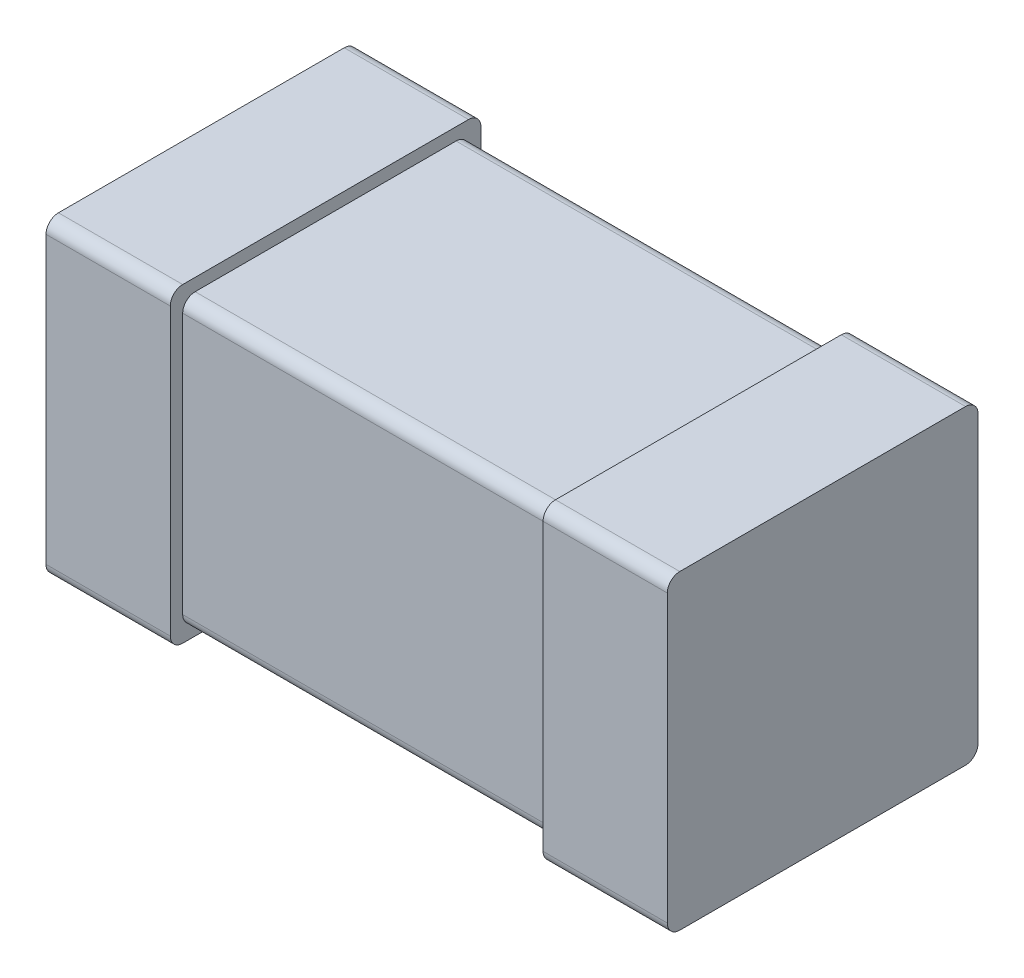
ISO-10303-21;
HEADER;
FILE_DESCRIPTION(('STEP AP214'),'2;1');
FILE_NAME('part.step','',(''),(''),'','','');
FILE_SCHEMA(('AUTOMOTIVE_DESIGN { 1 0 10303 214 1 1 1 1 }'));
ENDSEC;
DATA;
#1=APPLICATION_CONTEXT('core data for automotive mechanical design processes');
#2=APPLICATION_PROTOCOL_DEFINITION('international standard','automotive_design',2000,#1);
#3=PRODUCT_CONTEXT('',#1,'mechanical');
#4=PRODUCT('Part','Part','',(#3));
#5=PRODUCT_RELATED_PRODUCT_CATEGORY('part','',(#4));
#6=PRODUCT_DEFINITION_FORMATION('','',#4);
#7=PRODUCT_DEFINITION_CONTEXT('part definition',#1,'design');
#8=PRODUCT_DEFINITION('design','',#6,#7);
#9=PRODUCT_DEFINITION_SHAPE('','',#8);
#10=(LENGTH_UNIT() NAMED_UNIT(*) SI_UNIT(.MILLI.,.METRE.));
#11=(NAMED_UNIT(*) PLANE_ANGLE_UNIT() SI_UNIT($,.RADIAN.));
#12=(NAMED_UNIT(*) SI_UNIT($,.STERADIAN.) SOLID_ANGLE_UNIT());
#13=UNCERTAINTY_MEASURE_WITH_UNIT(LENGTH_MEASURE(1.E-05),#10,'distance_accuracy_value','');
#14=(GEOMETRIC_REPRESENTATION_CONTEXT(3) GLOBAL_UNCERTAINTY_ASSIGNED_CONTEXT((#13)) GLOBAL_UNIT_ASSIGNED_CONTEXT((#10,
#11,#12)) REPRESENTATION_CONTEXT('',''));
#15=CARTESIAN_POINT('',(0.,0.,0.));
#16=DIRECTION('',(0.,0.,1.));
#17=DIRECTION('',(1.,0.,0.));
#18=AXIS2_PLACEMENT_3D('',#15,#16,#17);
#19=CARTESIAN_POINT('',(0.5,-0.25,0.));
#20=DIRECTION('',(1.,0.,0.));
#21=DIRECTION('',(0.,1.,0.));
#22=AXIS2_PLACEMENT_3D('',#19,#20,#21);
#23=PLANE('',#22);
#24=DIRECTION('',(0.,0.,1.));
#25=VECTOR('',#24,1.);
#26=CARTESIAN_POINT('',(0.5,-0.25,0.));
#27=LINE('',#26,#25);
#28=CARTESIAN_POINT('',(0.5,-0.25,0.02));
#29=VERTEX_POINT('',#28);
#30=CARTESIAN_POINT('',(0.5,-0.25,0.48));
#31=VERTEX_POINT('',#30);
#32=EDGE_CURVE('E250',#29,#31,#27,.T.);
#33=ORIENTED_EDGE('',*,*,#32,.F.);
#34=CARTESIAN_POINT('',(0.5,-0.23,0.02));
#35=DIRECTION('',(1.,0.,0.));
#36=DIRECTION('',(0.,0.,1.));
#37=AXIS2_PLACEMENT_3D('',#34,#35,#36);
#38=CIRCLE('',#37,0.02);
#39=CARTESIAN_POINT('',(0.5,-0.23,0.));
#40=VERTEX_POINT('',#39);
#41=EDGE_CURVE('E290',#29,#40,#38,.T.);
#42=ORIENTED_EDGE('',*,*,#41,.T.);
#43=DIRECTION('',(0.,1.,0.));
#44=VECTOR('',#43,1.);
#45=CARTESIAN_POINT('',(0.5,-0.25,0.));
#46=LINE('',#45,#44);
#47=CARTESIAN_POINT('',(0.5,0.23,0.));
#48=VERTEX_POINT('',#47);
#49=EDGE_CURVE('E256',#40,#48,#46,.T.);
#50=ORIENTED_EDGE('',*,*,#49,.T.);
#51=CARTESIAN_POINT('',(0.5,0.23,0.02));
#52=DIRECTION('',(-1.,0.,0.));
#53=DIRECTION('',(0.,0.,1.));
#54=AXIS2_PLACEMENT_3D('',#51,#52,#53);
#55=CIRCLE('',#54,0.02);
#56=CARTESIAN_POINT('',(0.5,0.25,0.02));
#57=VERTEX_POINT('',#56);
#58=EDGE_CURVE('E229',#57,#48,#55,.T.);
#59=ORIENTED_EDGE('',*,*,#58,.F.);
#60=DIRECTION('',(0.,0.,1.));
#61=VECTOR('',#60,1.);
#62=CARTESIAN_POINT('',(0.5,0.25,0.));
#63=LINE('',#62,#61);
#64=CARTESIAN_POINT('',(0.5,0.25,0.48));
#65=VERTEX_POINT('',#64);
#66=EDGE_CURVE('E11',#57,#65,#63,.T.);
#67=ORIENTED_EDGE('',*,*,#66,.T.);
#68=CARTESIAN_POINT('',(0.5,0.23,0.48));
#69=DIRECTION('',(1.,0.,0.));
#70=DIRECTION('',(0.,0.,1.));
#71=AXIS2_PLACEMENT_3D('',#68,#69,#70);
#72=CIRCLE('',#71,0.02);
#73=CARTESIAN_POINT('',(0.5,0.23,0.5));
#74=VERTEX_POINT('',#73);
#75=EDGE_CURVE('E228',#65,#74,#72,.T.);
#76=ORIENTED_EDGE('',*,*,#75,.T.);
#77=DIRECTION('',(0.,1.,0.));
#78=VECTOR('',#77,1.);
#79=CARTESIAN_POINT('',(0.5,-0.25,0.5));
#80=LINE('',#79,#78);
#81=CARTESIAN_POINT('',(0.5,-0.23,0.5));
#82=VERTEX_POINT('',#81);
#83=EDGE_CURVE('E348',#82,#74,#80,.T.);
#84=ORIENTED_EDGE('',*,*,#83,.F.);
#85=CARTESIAN_POINT('',(0.5,-0.23,0.48));
#86=DIRECTION('',(-1.,0.,0.));
#87=DIRECTION('',(0.,0.,1.));
#88=AXIS2_PLACEMENT_3D('',#85,#86,#87);
#89=CIRCLE('',#88,0.02);
#90=EDGE_CURVE('E286',#31,#82,#89,.T.);
#91=ORIENTED_EDGE('',*,*,#90,.F.);
#92=EDGE_LOOP('',(#33,#42,#50,#59,#67,#76,#84,#91));
#93=FACE_BOUND('',#92,.T.);
#94=ADVANCED_FACE('F16',(#93),#23,.T.);
#95=CARTESIAN_POINT('',(0.3,0.25,0.));
#96=DIRECTION('',(0.,1.,0.));
#97=DIRECTION('',(1.,0.,0.));
#98=AXIS2_PLACEMENT_3D('',#95,#96,#97);
#99=PLANE('',#98);
#100=ORIENTED_EDGE('',*,*,#66,.F.);
#101=DIRECTION('',(1.,0.,0.));
#102=VECTOR('',#101,1.);
#103=CARTESIAN_POINT('',(0.3,0.25,0.02));
#104=LINE('',#103,#102);
#105=CARTESIAN_POINT('',(0.3,0.25,0.02));
#106=VERTEX_POINT('',#105);
#107=EDGE_CURVE('E277',#106,#57,#104,.T.);
#108=ORIENTED_EDGE('',*,*,#107,.F.);
#109=DIRECTION('',(0.,0.,1.));
#110=VECTOR('',#109,1.);
#111=CARTESIAN_POINT('',(0.3,0.25,0.));
#112=LINE('',#111,#110);
#113=CARTESIAN_POINT('',(0.3,0.25,0.48));
#114=VERTEX_POINT('',#113);
#115=EDGE_CURVE('E379',#106,#114,#112,.T.);
#116=ORIENTED_EDGE('',*,*,#115,.T.);
#117=DIRECTION('',(1.,0.,0.));
#118=VECTOR('',#117,1.);
#119=CARTESIAN_POINT('',(0.3,0.25,0.48));
#120=LINE('',#119,#118);
#121=EDGE_CURVE('E27',#114,#65,#120,.T.);
#122=ORIENTED_EDGE('',*,*,#121,.T.);
#123=EDGE_LOOP('',(#100,#108,#116,#122));
#124=FACE_BOUND('',#123,.T.);
#125=ADVANCED_FACE('F588',(#124),#99,.T.);
#126=CARTESIAN_POINT('',(0.3,0.23,0.48));
#127=DIRECTION('',(1.,0.,0.));
#128=DIRECTION('',(0.,1.,0.));
#129=AXIS2_PLACEMENT_3D('',#126,#127,#128);
#130=CYLINDRICAL_SURFACE('',#129,0.02);
#131=CARTESIAN_POINT('',(0.3,0.23,0.48));
#132=DIRECTION('',(1.,0.,0.));
#133=DIRECTION('',(0.,0.,1.));
#134=AXIS2_PLACEMENT_3D('',#131,#132,#133);
#135=CIRCLE('',#134,0.02);
#136=CARTESIAN_POINT('',(0.3,0.23,0.5));
#137=VERTEX_POINT('',#136);
#138=EDGE_CURVE('E334',#114,#137,#135,.T.);
#139=ORIENTED_EDGE('',*,*,#138,.T.);
#140=DIRECTION('',(1.,0.,0.));
#141=VECTOR('',#140,1.);
#142=CARTESIAN_POINT('',(0.3,0.23,0.5));
#143=LINE('',#142,#141);
#144=EDGE_CURVE('E281',#137,#74,#143,.T.);
#145=ORIENTED_EDGE('',*,*,#144,.T.);
#146=ORIENTED_EDGE('',*,*,#75,.F.);
#147=ORIENTED_EDGE('',*,*,#121,.F.);
#148=EDGE_LOOP('',(#139,#145,#146,#147));
#149=FACE_BOUND('',#148,.T.);
#150=ADVANCED_FACE('F582',(#149),#130,.T.);
#151=CARTESIAN_POINT('',(0.3,0.23,0.02));
#152=DIRECTION('',(1.,0.,0.));
#153=DIRECTION('',(0.,1.,0.));
#154=AXIS2_PLACEMENT_3D('',#151,#152,#153);
#155=CYLINDRICAL_SURFACE('',#154,0.02);
#156=ORIENTED_EDGE('',*,*,#107,.T.);
#157=ORIENTED_EDGE('',*,*,#58,.T.);
#158=DIRECTION('',(1.,0.,0.));
#159=VECTOR('',#158,1.);
#160=CARTESIAN_POINT('',(0.3,0.23,0.));
#161=LINE('',#160,#159);
#162=CARTESIAN_POINT('',(0.3,0.23,0.));
#163=VERTEX_POINT('',#162);
#164=EDGE_CURVE('E252',#163,#48,#161,.T.);
#165=ORIENTED_EDGE('',*,*,#164,.F.);
#166=CARTESIAN_POINT('',(0.3,0.23,0.02));
#167=DIRECTION('',(-1.,0.,0.));
#168=DIRECTION('',(0.,0.,1.));
#169=AXIS2_PLACEMENT_3D('',#166,#167,#168);
#170=CIRCLE('',#169,0.02);
#171=EDGE_CURVE('E398',#106,#163,#170,.T.);
#172=ORIENTED_EDGE('',*,*,#171,.F.);
#173=EDGE_LOOP('',(#156,#157,#165,#172));
#174=FACE_BOUND('',#173,.T.);
#175=ADVANCED_FACE('F587',(#174),#155,.T.);
#176=CARTESIAN_POINT('',(0.3,-0.25,0.5));
#177=DIRECTION('',(0.,0.,1.));
#178=DIRECTION('',(1.,0.,0.));
#179=AXIS2_PLACEMENT_3D('',#176,#177,#178);
#180=PLANE('',#179);
#181=DIRECTION('',(0.,1.,0.));
#182=VECTOR('',#181,1.);
#183=CARTESIAN_POINT('',(0.3,-0.25,0.5));
#184=LINE('',#183,#182);
#185=CARTESIAN_POINT('',(0.3,-0.23,0.5));
#186=VERTEX_POINT('',#185);
#187=EDGE_CURVE('E330',#186,#137,#184,.T.);
#188=ORIENTED_EDGE('',*,*,#187,.F.);
#189=DIRECTION('',(1.,0.,0.));
#190=VECTOR('',#189,1.);
#191=CARTESIAN_POINT('',(0.3,-0.23,0.5));
#192=LINE('',#191,#190);
#193=EDGE_CURVE('E257',#186,#82,#192,.T.);
#194=ORIENTED_EDGE('',*,*,#193,.T.);
#195=ORIENTED_EDGE('',*,*,#83,.T.);
#196=ORIENTED_EDGE('',*,*,#144,.F.);
#197=EDGE_LOOP('',(#188,#194,#195,#196));
#198=FACE_BOUND('',#197,.T.);
#199=ADVANCED_FACE('F636',(#198),#180,.T.);
#200=CARTESIAN_POINT('',(0.3,-0.25,0.));
#201=DIRECTION('',(0.,0.,1.));
#202=DIRECTION('',(1.,0.,0.));
#203=AXIS2_PLACEMENT_3D('',#200,#201,#202);
#204=PLANE('',#203);
#205=ORIENTED_EDGE('',*,*,#164,.T.);
#206=ORIENTED_EDGE('',*,*,#49,.F.);
#207=DIRECTION('',(1.,0.,0.));
#208=VECTOR('',#207,1.);
#209=CARTESIAN_POINT('',(0.3,-0.23,0.));
#210=LINE('',#209,#208);
#211=CARTESIAN_POINT('',(0.3,-0.23,0.));
#212=VERTEX_POINT('',#211);
#213=EDGE_CURVE('E272',#212,#40,#210,.T.);
#214=ORIENTED_EDGE('',*,*,#213,.F.);
#215=DIRECTION('',(0.,1.,0.));
#216=VECTOR('',#215,1.);
#217=CARTESIAN_POINT('',(0.3,-0.25,0.));
#218=LINE('',#217,#216);
#219=EDGE_CURVE('E415',#212,#163,#218,.T.);
#220=ORIENTED_EDGE('',*,*,#219,.T.);
#221=EDGE_LOOP('',(#205,#206,#214,#220));
#222=FACE_BOUND('',#221,.T.);
#223=ADVANCED_FACE('F602',(#222),#204,.F.);
#224=CARTESIAN_POINT('',(0.3,-0.23,0.48));
#225=DIRECTION('',(1.,0.,0.));
#226=DIRECTION('',(0.,-1.,0.));
#227=AXIS2_PLACEMENT_3D('',#224,#225,#226);
#228=CYLINDRICAL_SURFACE('',#227,0.02);
#229=DIRECTION('',(1.,0.,0.));
#230=VECTOR('',#229,1.);
#231=CARTESIAN_POINT('',(0.3,-0.25,0.48));
#232=LINE('',#231,#230);
#233=CARTESIAN_POINT('',(0.3,-0.25,0.48));
#234=VERTEX_POINT('',#233);
#235=EDGE_CURVE('E251',#234,#31,#232,.T.);
#236=ORIENTED_EDGE('',*,*,#235,.T.);
#237=ORIENTED_EDGE('',*,*,#90,.T.);
#238=ORIENTED_EDGE('',*,*,#193,.F.);
#239=CARTESIAN_POINT('',(0.3,-0.23,0.48));
#240=DIRECTION('',(-1.,0.,0.));
#241=DIRECTION('',(0.,0.,1.));
#242=AXIS2_PLACEMENT_3D('',#239,#240,#241);
#243=CIRCLE('',#242,0.02);
#244=EDGE_CURVE('E335',#234,#186,#243,.T.);
#245=ORIENTED_EDGE('',*,*,#244,.F.);
#246=EDGE_LOOP('',(#236,#237,#238,#245));
#247=FACE_BOUND('',#246,.T.);
#248=ADVANCED_FACE('F597',(#247),#228,.T.);
#249=CARTESIAN_POINT('',(0.3,-0.23,0.02));
#250=DIRECTION('',(1.,0.,0.));
#251=DIRECTION('',(0.,-1.,0.));
#252=AXIS2_PLACEMENT_3D('',#249,#250,#251);
#253=CYLINDRICAL_SURFACE('',#252,0.02);
#254=CARTESIAN_POINT('',(0.3,-0.23,0.02));
#255=DIRECTION('',(1.,0.,0.));
#256=DIRECTION('',(0.,0.,1.));
#257=AXIS2_PLACEMENT_3D('',#254,#255,#256);
#258=CIRCLE('',#257,0.02);
#259=CARTESIAN_POINT('',(0.3,-0.25,0.02));
#260=VERTEX_POINT('',#259);
#261=EDGE_CURVE('E20',#260,#212,#258,.T.);
#262=ORIENTED_EDGE('',*,*,#261,.T.);
#263=ORIENTED_EDGE('',*,*,#213,.T.);
#264=ORIENTED_EDGE('',*,*,#41,.F.);
#265=DIRECTION('',(1.,0.,0.));
#266=VECTOR('',#265,1.);
#267=CARTESIAN_POINT('',(0.3,-0.25,0.02));
#268=LINE('',#267,#266);
#269=EDGE_CURVE('E246',#260,#29,#268,.T.);
#270=ORIENTED_EDGE('',*,*,#269,.F.);
#271=EDGE_LOOP('',(#262,#263,#264,#270));
#272=FACE_BOUND('',#271,.T.);
#273=ADVANCED_FACE('F18',(#272),#253,.T.);
#274=CARTESIAN_POINT('',(0.3,-0.25,0.));
#275=DIRECTION('',(0.,1.,0.));
#276=DIRECTION('',(1.,0.,0.));
#277=AXIS2_PLACEMENT_3D('',#274,#275,#276);
#278=PLANE('',#277);
#279=ORIENTED_EDGE('',*,*,#235,.F.);
#280=DIRECTION('',(0.,0.,1.));
#281=VECTOR('',#280,1.);
#282=CARTESIAN_POINT('',(0.3,-0.25,0.));
#283=LINE('',#282,#281);
#284=EDGE_CURVE('E385',#260,#234,#283,.T.);
#285=ORIENTED_EDGE('',*,*,#284,.F.);
#286=ORIENTED_EDGE('',*,*,#269,.T.);
#287=ORIENTED_EDGE('',*,*,#32,.T.);
#288=EDGE_LOOP('',(#279,#285,#286,#287));
#289=FACE_BOUND('',#288,.T.);
#290=ADVANCED_FACE('F522',(#289),#278,.F.);
#291=CARTESIAN_POINT('',(0.3,-0.25,0.));
#292=DIRECTION('',(1.,0.,0.));
#293=DIRECTION('',(0.,1.,0.));
#294=AXIS2_PLACEMENT_3D('',#291,#292,#293);
#295=PLANE('',#294);
#296=DIRECTION('',(0.,1.,0.));
#297=VECTOR('',#296,1.);
#298=CARTESIAN_POINT('',(0.3,-0.23,0.02));
#299=LINE('',#298,#297);
#300=CARTESIAN_POINT('',(0.3,-0.21,0.02));
#301=VERTEX_POINT('',#300);
#302=CARTESIAN_POINT('',(0.3,0.21,0.02));
#303=VERTEX_POINT('',#302);
#304=EDGE_CURVE('E301',#301,#303,#299,.T.);
#305=ORIENTED_EDGE('',*,*,#304,.T.);
#306=CARTESIAN_POINT('',(0.3,0.21,0.04));
#307=DIRECTION('',(-1.,0.,0.));
#308=DIRECTION('',(0.,0.,1.));
#309=AXIS2_PLACEMENT_3D('',#306,#307,#308);
#310=CIRCLE('',#309,0.02);
#311=CARTESIAN_POINT('',(0.3,0.23,0.04));
#312=VERTEX_POINT('',#311);
#313=EDGE_CURVE('E300',#312,#303,#310,.T.);
#314=ORIENTED_EDGE('',*,*,#313,.F.);
#315=DIRECTION('',(0.,0.,1.));
#316=VECTOR('',#315,1.);
#317=CARTESIAN_POINT('',(0.3,0.23,0.02));
#318=LINE('',#317,#316);
#319=CARTESIAN_POINT('',(0.3,0.23,0.46));
#320=VERTEX_POINT('',#319);
#321=EDGE_CURVE('E341',#312,#320,#318,.T.);
#322=ORIENTED_EDGE('',*,*,#321,.T.);
#323=CARTESIAN_POINT('',(0.3,0.21,0.46));
#324=DIRECTION('',(1.,0.,0.));
#325=DIRECTION('',(0.,0.,1.));
#326=AXIS2_PLACEMENT_3D('',#323,#324,#325);
#327=CIRCLE('',#326,0.02);
#328=CARTESIAN_POINT('',(0.3,0.21,0.48));
#329=VERTEX_POINT('',#328);
#330=EDGE_CURVE('E295',#320,#329,#327,.T.);
#331=ORIENTED_EDGE('',*,*,#330,.T.);
#332=DIRECTION('',(0.,1.,0.));
#333=VECTOR('',#332,1.);
#334=CARTESIAN_POINT('',(0.3,-0.23,0.48));
#335=LINE('',#334,#333);
#336=CARTESIAN_POINT('',(0.3,-0.21,0.48));
#337=VERTEX_POINT('',#336);
#338=EDGE_CURVE('E355',#337,#329,#335,.T.);
#339=ORIENTED_EDGE('',*,*,#338,.F.);
#340=CARTESIAN_POINT('',(0.3,-0.21,0.46));
#341=DIRECTION('',(-1.,0.,0.));
#342=DIRECTION('',(0.,0.,1.));
#343=AXIS2_PLACEMENT_3D('',#340,#341,#342);
#344=CIRCLE('',#343,0.02);
#345=CARTESIAN_POINT('',(0.3,-0.23,0.46));
#346=VERTEX_POINT('',#345);
#347=EDGE_CURVE('E342',#346,#337,#344,.T.);
#348=ORIENTED_EDGE('',*,*,#347,.F.);
#349=DIRECTION('',(0.,0.,1.));
#350=VECTOR('',#349,1.);
#351=CARTESIAN_POINT('',(0.3,-0.23,0.02));
#352=LINE('',#351,#350);
#353=CARTESIAN_POINT('',(0.3,-0.23,0.04));
#354=VERTEX_POINT('',#353);
#355=EDGE_CURVE('E346',#354,#346,#352,.T.);
#356=ORIENTED_EDGE('',*,*,#355,.F.);
#357=CARTESIAN_POINT('',(0.3,-0.21,0.04));
#358=DIRECTION('',(1.,0.,0.));
#359=DIRECTION('',(0.,0.,1.));
#360=AXIS2_PLACEMENT_3D('',#357,#358,#359);
#361=CIRCLE('',#360,0.02);
#362=EDGE_CURVE('E236',#354,#301,#361,.T.);
#363=ORIENTED_EDGE('',*,*,#362,.T.);
#364=EDGE_LOOP('',(#305,#314,#322,#331,#339,#348,#356,#363));
#365=FACE_BOUND('',#364,.T.);
#366=ORIENTED_EDGE('',*,*,#244,.T.);
#367=ORIENTED_EDGE('',*,*,#187,.T.);
#368=ORIENTED_EDGE('',*,*,#138,.F.);
#369=ORIENTED_EDGE('',*,*,#115,.F.);
#370=ORIENTED_EDGE('',*,*,#171,.T.);
#371=ORIENTED_EDGE('',*,*,#219,.F.);
#372=ORIENTED_EDGE('',*,*,#261,.F.);
#373=ORIENTED_EDGE('',*,*,#284,.T.);
#374=EDGE_LOOP('',(#366,#367,#368,#369,#370,#371,#372,#373));
#375=FACE_BOUND('',#374,.T.);
#376=ADVANCED_FACE('F425',(#365,#375),#295,.F.);
#377=CARTESIAN_POINT('',(-0.3,-0.23,0.02));
#378=DIRECTION('',(0.,1.,0.));
#379=DIRECTION('',(1.,0.,0.));
#380=AXIS2_PLACEMENT_3D('',#377,#378,#379);
#381=PLANE('',#380);
#382=DIRECTION('',(1.,0.,0.));
#383=VECTOR('',#382,1.);
#384=CARTESIAN_POINT('',(-0.3,-0.23,0.46));
#385=LINE('',#384,#383);
#386=CARTESIAN_POINT('',(-0.3,-0.23,0.46));
#387=VERTEX_POINT('',#386);
#388=EDGE_CURVE('E347',#387,#346,#385,.T.);
#389=ORIENTED_EDGE('',*,*,#388,.F.);
#390=DIRECTION('',(0.,0.,1.));
#391=VECTOR('',#390,1.);
#392=CARTESIAN_POINT('',(-0.3,-0.23,0.02));
#393=LINE('',#392,#391);
#394=CARTESIAN_POINT('',(-0.3,-0.23,0.04));
#395=VERTEX_POINT('',#394);
#396=EDGE_CURVE('E263',#395,#387,#393,.T.);
#397=ORIENTED_EDGE('',*,*,#396,.F.);
#398=DIRECTION('',(1.,0.,0.));
#399=VECTOR('',#398,1.);
#400=CARTESIAN_POINT('',(-0.3,-0.23,0.04));
#401=LINE('',#400,#399);
#402=EDGE_CURVE('E231',#395,#354,#401,.T.);
#403=ORIENTED_EDGE('',*,*,#402,.T.);
#404=ORIENTED_EDGE('',*,*,#355,.T.);
#405=EDGE_LOOP('',(#389,#397,#403,#404));
#406=FACE_BOUND('',#405,.T.);
#407=ADVANCED_FACE('F546',(#406),#381,.F.);
#408=CARTESIAN_POINT('',(-0.3,-0.21,0.46));
#409=DIRECTION('',(1.,0.,0.));
#410=DIRECTION('',(0.,-1.,0.));
#411=AXIS2_PLACEMENT_3D('',#408,#409,#410);
#412=CYLINDRICAL_SURFACE('',#411,0.02);
#413=ORIENTED_EDGE('',*,*,#388,.T.);
#414=ORIENTED_EDGE('',*,*,#347,.T.);
#415=DIRECTION('',(1.,0.,0.));
#416=VECTOR('',#415,1.);
#417=CARTESIAN_POINT('',(-0.3,-0.21,0.48));
#418=LINE('',#417,#416);
#419=CARTESIAN_POINT('',(-0.3,-0.21,0.48));
#420=VERTEX_POINT('',#419);
#421=EDGE_CURVE('E405',#420,#337,#418,.T.);
#422=ORIENTED_EDGE('',*,*,#421,.F.);
#423=CARTESIAN_POINT('',(-0.3,-0.21,0.46));
#424=DIRECTION('',(-1.,0.,0.));
#425=DIRECTION('',(0.,0.,1.));
#426=AXIS2_PLACEMENT_3D('',#423,#424,#425);
#427=CIRCLE('',#426,0.02);
#428=EDGE_CURVE('E267',#387,#420,#427,.T.);
#429=ORIENTED_EDGE('',*,*,#428,.F.);
#430=EDGE_LOOP('',(#413,#414,#422,#429));
#431=FACE_BOUND('',#430,.T.);
#432=ADVANCED_FACE('F551',(#431),#412,.T.);
#433=CARTESIAN_POINT('',(-0.3,-0.23,0.48));
#434=DIRECTION('',(0.,0.,1.));
#435=DIRECTION('',(1.,0.,0.));
#436=AXIS2_PLACEMENT_3D('',#433,#434,#435);
#437=PLANE('',#436);
#438=DIRECTION('',(0.,1.,0.));
#439=VECTOR('',#438,1.);
#440=CARTESIAN_POINT('',(-0.3,-0.23,0.48));
#441=LINE('',#440,#439);
#442=CARTESIAN_POINT('',(-0.3,0.21,0.48));
#443=VERTEX_POINT('',#442);
#444=EDGE_CURVE('E317',#420,#443,#441,.T.);
#445=ORIENTED_EDGE('',*,*,#444,.F.);
#446=ORIENTED_EDGE('',*,*,#421,.T.);
#447=ORIENTED_EDGE('',*,*,#338,.T.);
#448=DIRECTION('',(1.,0.,0.));
#449=VECTOR('',#448,1.);
#450=CARTESIAN_POINT('',(-0.3,0.21,0.48));
#451=LINE('',#450,#449);
#452=EDGE_CURVE('E291',#443,#329,#451,.T.);
#453=ORIENTED_EDGE('',*,*,#452,.F.);
#454=EDGE_LOOP('',(#445,#446,#447,#453));
#455=FACE_BOUND('',#454,.T.);
#456=ADVANCED_FACE('F440',(#455),#437,.T.);
#457=CARTESIAN_POINT('',(-0.3,0.21,0.46));
#458=DIRECTION('',(1.,0.,0.));
#459=DIRECTION('',(0.,1.,0.));
#460=AXIS2_PLACEMENT_3D('',#457,#458,#459);
#461=CYLINDRICAL_SURFACE('',#460,0.02);
#462=CARTESIAN_POINT('',(-0.3,0.21,0.46));
#463=DIRECTION('',(1.,0.,0.));
#464=DIRECTION('',(0.,0.,1.));
#465=AXIS2_PLACEMENT_3D('',#462,#463,#464);
#466=CIRCLE('',#465,0.02);
#467=CARTESIAN_POINT('',(-0.3,0.23,0.46));
#468=VERTEX_POINT('',#467);
#469=EDGE_CURVE('E313',#468,#443,#466,.T.);
#470=ORIENTED_EDGE('',*,*,#469,.T.);
#471=ORIENTED_EDGE('',*,*,#452,.T.);
#472=ORIENTED_EDGE('',*,*,#330,.F.);
#473=DIRECTION('',(1.,0.,0.));
#474=VECTOR('',#473,1.);
#475=CARTESIAN_POINT('',(-0.3,0.23,0.46));
#476=LINE('',#475,#474);
#477=EDGE_CURVE('E296',#468,#320,#476,.T.);
#478=ORIENTED_EDGE('',*,*,#477,.F.);
#479=EDGE_LOOP('',(#470,#471,#472,#478));
#480=FACE_BOUND('',#479,.T.);
#481=ADVANCED_FACE('F435',(#480),#461,.T.);
#482=CARTESIAN_POINT('',(-0.3,0.23,0.02));
#483=DIRECTION('',(0.,1.,0.));
#484=DIRECTION('',(1.,0.,0.));
#485=AXIS2_PLACEMENT_3D('',#482,#483,#484);
#486=PLANE('',#485);
#487=ORIENTED_EDGE('',*,*,#321,.F.);
#488=DIRECTION('',(1.,0.,0.));
#489=VECTOR('',#488,1.);
#490=CARTESIAN_POINT('',(-0.3,0.23,0.04));
#491=LINE('',#490,#489);
#492=CARTESIAN_POINT('',(-0.3,0.23,0.04));
#493=VERTEX_POINT('',#492);
#494=EDGE_CURVE('E297',#493,#312,#491,.T.);
#495=ORIENTED_EDGE('',*,*,#494,.F.);
#496=DIRECTION('',(0.,0.,1.));
#497=VECTOR('',#496,1.);
#498=CARTESIAN_POINT('',(-0.3,0.23,0.02));
#499=LINE('',#498,#497);
#500=EDGE_CURVE('E312',#493,#468,#499,.T.);
#501=ORIENTED_EDGE('',*,*,#500,.T.);
#502=ORIENTED_EDGE('',*,*,#477,.T.);
#503=EDGE_LOOP('',(#487,#495,#501,#502));
#504=FACE_BOUND('',#503,.T.);
#505=ADVANCED_FACE('F528',(#504),#486,.T.);
#506=CARTESIAN_POINT('',(-0.3,0.21,0.04));
#507=DIRECTION('',(1.,0.,0.));
#508=DIRECTION('',(0.,1.,0.));
#509=AXIS2_PLACEMENT_3D('',#506,#507,#508);
#510=CYLINDRICAL_SURFACE('',#509,0.02);
#511=ORIENTED_EDGE('',*,*,#494,.T.);
#512=ORIENTED_EDGE('',*,*,#313,.T.);
#513=DIRECTION('',(1.,0.,0.));
#514=VECTOR('',#513,1.);
#515=CARTESIAN_POINT('',(-0.3,0.21,0.02));
#516=LINE('',#515,#514);
#517=CARTESIAN_POINT('',(-0.3,0.21,0.02));
#518=VERTEX_POINT('',#517);
#519=EDGE_CURVE('E235',#518,#303,#516,.T.);
#520=ORIENTED_EDGE('',*,*,#519,.F.);
#521=CARTESIAN_POINT('',(-0.3,0.21,0.04));
#522=DIRECTION('',(-1.,0.,0.));
#523=DIRECTION('',(0.,0.,1.));
#524=AXIS2_PLACEMENT_3D('',#521,#522,#523);
#525=CIRCLE('',#524,0.02);
#526=EDGE_CURVE('E308',#493,#518,#525,.T.);
#527=ORIENTED_EDGE('',*,*,#526,.F.);
#528=EDGE_LOOP('',(#511,#512,#520,#527));
#529=FACE_BOUND('',#528,.T.);
#530=ADVANCED_FACE('F534',(#529),#510,.T.);
#531=CARTESIAN_POINT('',(-0.3,-0.23,0.02));
#532=DIRECTION('',(0.,0.,1.));
#533=DIRECTION('',(1.,0.,0.));
#534=AXIS2_PLACEMENT_3D('',#531,#532,#533);
#535=PLANE('',#534);
#536=ORIENTED_EDGE('',*,*,#519,.T.);
#537=ORIENTED_EDGE('',*,*,#304,.F.);
#538=DIRECTION('',(1.,0.,0.));
#539=VECTOR('',#538,1.);
#540=CARTESIAN_POINT('',(-0.3,-0.21,0.02));
#541=LINE('',#540,#539);
#542=CARTESIAN_POINT('',(-0.3,-0.21,0.02));
#543=VERTEX_POINT('',#542);
#544=EDGE_CURVE('E258',#543,#301,#541,.T.);
#545=ORIENTED_EDGE('',*,*,#544,.F.);
#546=DIRECTION('',(0.,1.,0.));
#547=VECTOR('',#546,1.);
#548=CARTESIAN_POINT('',(-0.3,-0.23,0.02));
#549=LINE('',#548,#547);
#550=EDGE_CURVE('E262',#543,#518,#549,.T.);
#551=ORIENTED_EDGE('',*,*,#550,.T.);
#552=EDGE_LOOP('',(#536,#537,#545,#551));
#553=FACE_BOUND('',#552,.T.);
#554=ADVANCED_FACE('F656',(#553),#535,.F.);
#555=CARTESIAN_POINT('',(-0.3,-0.21,0.04));
#556=DIRECTION('',(1.,0.,0.));
#557=DIRECTION('',(0.,-1.,0.));
#558=AXIS2_PLACEMENT_3D('',#555,#556,#557);
#559=CYLINDRICAL_SURFACE('',#558,0.02);
#560=CARTESIAN_POINT('',(-0.3,-0.21,0.04));
#561=DIRECTION('',(1.,0.,0.));
#562=DIRECTION('',(0.,0.,1.));
#563=AXIS2_PLACEMENT_3D('',#560,#561,#562);
#564=CIRCLE('',#563,0.02);
#565=EDGE_CURVE('E268',#395,#543,#564,.T.);
#566=ORIENTED_EDGE('',*,*,#565,.T.);
#567=ORIENTED_EDGE('',*,*,#544,.T.);
#568=ORIENTED_EDGE('',*,*,#362,.F.);
#569=ORIENTED_EDGE('',*,*,#402,.F.);
#570=EDGE_LOOP('',(#566,#567,#568,#569));
#571=FACE_BOUND('',#570,.T.);
#572=ADVANCED_FACE('F668',(#571),#559,.T.);
#573=CARTESIAN_POINT('',(-0.3,-0.25,0.));
#574=DIRECTION('',(1.,0.,0.));
#575=DIRECTION('',(0.,1.,0.));
#576=AXIS2_PLACEMENT_3D('',#573,#574,#575);
#577=PLANE('',#576);
#578=ORIENTED_EDGE('',*,*,#565,.F.);
#579=ORIENTED_EDGE('',*,*,#396,.T.);
#580=ORIENTED_EDGE('',*,*,#428,.T.);
#581=ORIENTED_EDGE('',*,*,#444,.T.);
#582=ORIENTED_EDGE('',*,*,#469,.F.);
#583=ORIENTED_EDGE('',*,*,#500,.F.);
#584=ORIENTED_EDGE('',*,*,#526,.T.);
#585=ORIENTED_EDGE('',*,*,#550,.F.);
#586=EDGE_LOOP('',(#578,#579,#580,#581,#582,#583,#584,#585));
#587=FACE_BOUND('',#586,.T.);
#588=DIRECTION('',(0.,0.,1.));
#589=VECTOR('',#588,1.);
#590=CARTESIAN_POINT('',(-0.3,-0.25,0.));
#591=LINE('',#590,#589);
#592=CARTESIAN_POINT('',(-0.3,-0.25,0.02));
#593=VERTEX_POINT('',#592);
#594=CARTESIAN_POINT('',(-0.3,-0.25,0.48));
#595=VERTEX_POINT('',#594);
#596=EDGE_CURVE('E240',#593,#595,#591,.T.);
#597=ORIENTED_EDGE('',*,*,#596,.F.);
#598=CARTESIAN_POINT('',(-0.3,-0.23,0.02));
#599=DIRECTION('',(1.,0.,0.));
#600=DIRECTION('',(0.,0.,1.));
#601=AXIS2_PLACEMENT_3D('',#598,#599,#600);
#602=CIRCLE('',#601,0.02);
#603=CARTESIAN_POINT('',(-0.3,-0.23,0.));
#604=VERTEX_POINT('',#603);
#605=EDGE_CURVE('E239',#593,#604,#602,.T.);
#606=ORIENTED_EDGE('',*,*,#605,.T.);
#607=DIRECTION('',(0.,1.,0.));
#608=VECTOR('',#607,1.);
#609=CARTESIAN_POINT('',(-0.3,-0.25,0.));
#610=LINE('',#609,#608);
#611=CARTESIAN_POINT('',(-0.3,0.23,0.));
#612=VERTEX_POINT('',#611);
#613=EDGE_CURVE('E197',#604,#612,#610,.T.);
#614=ORIENTED_EDGE('',*,*,#613,.T.);
#615=CARTESIAN_POINT('',(-0.3,0.23,0.02));
#616=DIRECTION('',(-1.,0.,0.));
#617=DIRECTION('',(0.,0.,1.));
#618=AXIS2_PLACEMENT_3D('',#615,#616,#617);
#619=CIRCLE('',#618,0.02);
#620=CARTESIAN_POINT('',(-0.3,0.25,0.02));
#621=VERTEX_POINT('',#620);
#622=EDGE_CURVE('E192',#621,#612,#619,.T.);
#623=ORIENTED_EDGE('',*,*,#622,.F.);
#624=DIRECTION('',(0.,0.,1.));
#625=VECTOR('',#624,1.);
#626=CARTESIAN_POINT('',(-0.3,0.25,0.));
#627=LINE('',#626,#625);
#628=CARTESIAN_POINT('',(-0.3,0.25,0.48));
#629=VERTEX_POINT('',#628);
#630=EDGE_CURVE('E324',#621,#629,#627,.T.);
#631=ORIENTED_EDGE('',*,*,#630,.T.);
#632=CARTESIAN_POINT('',(-0.3,0.23,0.48));
#633=DIRECTION('',(1.,0.,0.));
#634=DIRECTION('',(0.,0.,1.));
#635=AXIS2_PLACEMENT_3D('',#632,#633,#634);
#636=CIRCLE('',#635,0.02);
#637=CARTESIAN_POINT('',(-0.3,0.23,0.5));
#638=VERTEX_POINT('',#637);
#639=EDGE_CURVE('E245',#629,#638,#636,.T.);
#640=ORIENTED_EDGE('',*,*,#639,.T.);
#641=DIRECTION('',(0.,1.,0.));
#642=VECTOR('',#641,1.);
#643=CARTESIAN_POINT('',(-0.3,-0.25,0.5));
#644=LINE('',#643,#642);
#645=CARTESIAN_POINT('',(-0.3,-0.23,0.5));
#646=VERTEX_POINT('',#645);
#647=EDGE_CURVE('E329',#646,#638,#644,.T.);
#648=ORIENTED_EDGE('',*,*,#647,.F.);
#649=CARTESIAN_POINT('',(-0.3,-0.23,0.48));
#650=DIRECTION('',(-1.,0.,0.));
#651=DIRECTION('',(0.,0.,1.));
#652=AXIS2_PLACEMENT_3D('',#649,#650,#651);
#653=CIRCLE('',#652,0.02);
#654=EDGE_CURVE('E276',#595,#646,#653,.T.);
#655=ORIENTED_EDGE('',*,*,#654,.F.);
#656=EDGE_LOOP('',(#597,#606,#614,#623,#631,#640,#648,#655));
#657=FACE_BOUND('',#656,.T.);
#658=ADVANCED_FACE('F487',(#587,#657),#577,.T.);
#659=CARTESIAN_POINT('',(-0.5,0.25,0.));
#660=DIRECTION('',(0.,1.,0.));
#661=DIRECTION('',(1.,0.,0.));
#662=AXIS2_PLACEMENT_3D('',#659,#660,#661);
#663=PLANE('',#662);
#664=ORIENTED_EDGE('',*,*,#630,.F.);
#665=DIRECTION('',(1.,0.,0.));
#666=VECTOR('',#665,1.);
#667=CARTESIAN_POINT('',(-0.5,0.25,0.02));
#668=LINE('',#667,#666);
#669=CARTESIAN_POINT('',(-0.5,0.25,0.02));
#670=VERTEX_POINT('',#669);
#671=EDGE_CURVE('E226',#670,#621,#668,.T.);
#672=ORIENTED_EDGE('',*,*,#671,.F.);
#673=DIRECTION('',(0.,0.,1.));
#674=VECTOR('',#673,1.);
#675=CARTESIAN_POINT('',(-0.5,0.25,0.));
#676=LINE('',#675,#674);
#677=CARTESIAN_POINT('',(-0.5,0.25,0.48));
#678=VERTEX_POINT('',#677);
#679=EDGE_CURVE('E215',#670,#678,#676,.T.);
#680=ORIENTED_EDGE('',*,*,#679,.T.);
#681=DIRECTION('',(1.,0.,0.));
#682=VECTOR('',#681,1.);
#683=CARTESIAN_POINT('',(-0.5,0.25,0.48));
#684=LINE('',#683,#682);
#685=EDGE_CURVE('E358',#678,#629,#684,.T.);
#686=ORIENTED_EDGE('',*,*,#685,.T.);
#687=EDGE_LOOP('',(#664,#672,#680,#686));
#688=FACE_BOUND('',#687,.T.);
#689=ADVANCED_FACE('F615',(#688),#663,.T.);
#690=CARTESIAN_POINT('',(-0.5,0.23,0.48));
#691=DIRECTION('',(1.,0.,0.));
#692=DIRECTION('',(0.,1.,0.));
#693=AXIS2_PLACEMENT_3D('',#690,#691,#692);
#694=CYLINDRICAL_SURFACE('',#693,0.02);
#695=CARTESIAN_POINT('',(-0.5,0.23,0.48));
#696=DIRECTION('',(1.,0.,0.));
#697=DIRECTION('',(0.,0.,1.));
#698=AXIS2_PLACEMENT_3D('',#695,#696,#697);
#699=CIRCLE('',#698,0.02);
#700=CARTESIAN_POINT('',(-0.5,0.23,0.5));
#701=VERTEX_POINT('',#700);
#702=EDGE_CURVE('E222',#678,#701,#699,.T.);
#703=ORIENTED_EDGE('',*,*,#702,.T.);
#704=DIRECTION('',(1.,0.,0.));
#705=VECTOR('',#704,1.);
#706=CARTESIAN_POINT('',(-0.5,0.23,0.5));
#707=LINE('',#706,#705);
#708=EDGE_CURVE('E325',#701,#638,#707,.T.);
#709=ORIENTED_EDGE('',*,*,#708,.T.);
#710=ORIENTED_EDGE('',*,*,#639,.F.);
#711=ORIENTED_EDGE('',*,*,#685,.F.);
#712=EDGE_LOOP('',(#703,#709,#710,#711));
#713=FACE_BOUND('',#712,.T.);
#714=ADVANCED_FACE('F610',(#713),#694,.T.);
#715=CARTESIAN_POINT('',(-0.5,0.23,0.02));
#716=DIRECTION('',(1.,0.,0.));
#717=DIRECTION('',(0.,1.,0.));
#718=AXIS2_PLACEMENT_3D('',#715,#716,#717);
#719=CYLINDRICAL_SURFACE('',#718,0.02);
#720=ORIENTED_EDGE('',*,*,#671,.T.);
#721=ORIENTED_EDGE('',*,*,#622,.T.);
#722=DIRECTION('',(1.,0.,0.));
#723=VECTOR('',#722,1.);
#724=CARTESIAN_POINT('',(-0.5,0.23,0.));
#725=LINE('',#724,#723);
#726=CARTESIAN_POINT('',(-0.5,0.23,0.));
#727=VERTEX_POINT('',#726);
#728=EDGE_CURVE('E184',#727,#612,#725,.T.);
#729=ORIENTED_EDGE('',*,*,#728,.F.);
#730=CARTESIAN_POINT('',(-0.5,0.23,0.02));
#731=DIRECTION('',(-1.,0.,0.));
#732=DIRECTION('',(0.,0.,1.));
#733=AXIS2_PLACEMENT_3D('',#730,#731,#732);
#734=CIRCLE('',#733,0.02);
#735=EDGE_CURVE('E189',#670,#727,#734,.T.);
#736=ORIENTED_EDGE('',*,*,#735,.F.);
#737=EDGE_LOOP('',(#720,#721,#729,#736));
#738=FACE_BOUND('',#737,.T.);
#739=ADVANCED_FACE('F187',(#738),#719,.T.);
#740=CARTESIAN_POINT('',(-0.5,-0.25,0.5));
#741=DIRECTION('',(0.,0.,1.));
#742=DIRECTION('',(1.,0.,0.));
#743=AXIS2_PLACEMENT_3D('',#740,#741,#742);
#744=PLANE('',#743);
#745=DIRECTION('',(0.,1.,0.));
#746=VECTOR('',#745,1.);
#747=CARTESIAN_POINT('',(-0.5,-0.25,0.5));
#748=LINE('',#747,#746);
#749=CARTESIAN_POINT('',(-0.5,-0.23,0.5));
#750=VERTEX_POINT('',#749);
#751=EDGE_CURVE('E303',#750,#701,#748,.T.);
#752=ORIENTED_EDGE('',*,*,#751,.F.);
#753=DIRECTION('',(1.,0.,0.));
#754=VECTOR('',#753,1.);
#755=CARTESIAN_POINT('',(-0.5,-0.23,0.5));
#756=LINE('',#755,#754);
#757=EDGE_CURVE('E198',#750,#646,#756,.T.);
#758=ORIENTED_EDGE('',*,*,#757,.T.);
#759=ORIENTED_EDGE('',*,*,#647,.T.);
#760=ORIENTED_EDGE('',*,*,#708,.F.);
#761=EDGE_LOOP('',(#752,#758,#759,#760));
#762=FACE_BOUND('',#761,.T.);
#763=ADVANCED_FACE('F484',(#762),#744,.T.);
#764=CARTESIAN_POINT('',(-0.5,-0.25,0.));
#765=DIRECTION('',(0.,0.,1.));
#766=DIRECTION('',(1.,0.,0.));
#767=AXIS2_PLACEMENT_3D('',#764,#765,#766);
#768=PLANE('',#767);
#769=ORIENTED_EDGE('',*,*,#728,.T.);
#770=ORIENTED_EDGE('',*,*,#613,.F.);
#771=DIRECTION('',(1.,0.,0.));
#772=VECTOR('',#771,1.);
#773=CARTESIAN_POINT('',(-0.5,-0.23,0.));
#774=LINE('',#773,#772);
#775=CARTESIAN_POINT('',(-0.5,-0.23,0.));
#776=VERTEX_POINT('',#775);
#777=EDGE_CURVE('E204',#776,#604,#774,.T.);
#778=ORIENTED_EDGE('',*,*,#777,.F.);
#779=DIRECTION('',(0.,1.,0.));
#780=VECTOR('',#779,1.);
#781=CARTESIAN_POINT('',(-0.5,-0.25,0.));
#782=LINE('',#781,#780);
#783=EDGE_CURVE('E201',#776,#727,#782,.T.);
#784=ORIENTED_EDGE('',*,*,#783,.T.);
#785=EDGE_LOOP('',(#769,#770,#778,#784));
#786=FACE_BOUND('',#785,.T.);
#787=ADVANCED_FACE('F202',(#786),#768,.F.);
#788=CARTESIAN_POINT('',(-0.5,-0.23,0.48));
#789=DIRECTION('',(1.,0.,0.));
#790=DIRECTION('',(0.,-1.,0.));
#791=AXIS2_PLACEMENT_3D('',#788,#789,#790);
#792=CYLINDRICAL_SURFACE('',#791,0.02);
#793=DIRECTION('',(1.,0.,0.));
#794=VECTOR('',#793,1.);
#795=CARTESIAN_POINT('',(-0.5,-0.25,0.48));
#796=LINE('',#795,#794);
#797=CARTESIAN_POINT('',(-0.5,-0.25,0.48));
#798=VERTEX_POINT('',#797);
#799=EDGE_CURVE('E373',#798,#595,#796,.T.);
#800=ORIENTED_EDGE('',*,*,#799,.T.);
#801=ORIENTED_EDGE('',*,*,#654,.T.);
#802=ORIENTED_EDGE('',*,*,#757,.F.);
#803=CARTESIAN_POINT('',(-0.5,-0.23,0.48));
#804=DIRECTION('',(-1.,0.,0.));
#805=DIRECTION('',(0.,0.,1.));
#806=AXIS2_PLACEMENT_3D('',#803,#804,#805);
#807=CIRCLE('',#806,0.02);
#808=EDGE_CURVE('E307',#798,#750,#807,.T.);
#809=ORIENTED_EDGE('',*,*,#808,.F.);
#810=EDGE_LOOP('',(#800,#801,#802,#809));
#811=FACE_BOUND('',#810,.T.);
#812=ADVANCED_FACE('F708',(#811),#792,.T.);
#813=CARTESIAN_POINT('',(-0.5,-0.23,0.02));
#814=DIRECTION('',(1.,0.,0.));
#815=DIRECTION('',(0.,-1.,0.));
#816=AXIS2_PLACEMENT_3D('',#813,#814,#815);
#817=CYLINDRICAL_SURFACE('',#816,0.02);
#818=CARTESIAN_POINT('',(-0.5,-0.23,0.02));
#819=DIRECTION('',(1.,0.,0.));
#820=DIRECTION('',(0.,0.,1.));
#821=AXIS2_PLACEMENT_3D('',#818,#819,#820);
#822=CIRCLE('',#821,0.02);
#823=CARTESIAN_POINT('',(-0.5,-0.25,0.02));
#824=VERTEX_POINT('',#823);
#825=EDGE_CURVE('E209',#824,#776,#822,.T.);
#826=ORIENTED_EDGE('',*,*,#825,.T.);
#827=ORIENTED_EDGE('',*,*,#777,.T.);
#828=ORIENTED_EDGE('',*,*,#605,.F.);
#829=DIRECTION('',(1.,0.,0.));
#830=VECTOR('',#829,1.);
#831=CARTESIAN_POINT('',(-0.5,-0.25,0.02));
#832=LINE('',#831,#830);
#833=EDGE_CURVE('E285',#824,#593,#832,.T.);
#834=ORIENTED_EDGE('',*,*,#833,.F.);
#835=EDGE_LOOP('',(#826,#827,#828,#834));
#836=FACE_BOUND('',#835,.T.);
#837=ADVANCED_FACE('F715',(#836),#817,.T.);
#838=CARTESIAN_POINT('',(-0.5,-0.25,0.));
#839=DIRECTION('',(0.,1.,0.));
#840=DIRECTION('',(1.,0.,0.));
#841=AXIS2_PLACEMENT_3D('',#838,#839,#840);
#842=PLANE('',#841);
#843=ORIENTED_EDGE('',*,*,#799,.F.);
#844=DIRECTION('',(0.,0.,1.));
#845=VECTOR('',#844,1.);
#846=CARTESIAN_POINT('',(-0.5,-0.25,0.));
#847=LINE('',#846,#845);
#848=EDGE_CURVE('E384',#824,#798,#847,.T.);
#849=ORIENTED_EDGE('',*,*,#848,.F.);
#850=ORIENTED_EDGE('',*,*,#833,.T.);
#851=ORIENTED_EDGE('',*,*,#596,.T.);
#852=EDGE_LOOP('',(#843,#849,#850,#851));
#853=FACE_BOUND('',#852,.T.);
#854=ADVANCED_FACE('F565',(#853),#842,.F.);
#855=CARTESIAN_POINT('',(-0.5,-0.25,0.));
#856=DIRECTION('',(1.,0.,0.));
#857=DIRECTION('',(0.,1.,0.));
#858=AXIS2_PLACEMENT_3D('',#855,#856,#857);
#859=PLANE('',#858);
#860=ORIENTED_EDGE('',*,*,#808,.T.);
#861=ORIENTED_EDGE('',*,*,#751,.T.);
#862=ORIENTED_EDGE('',*,*,#702,.F.);
#863=ORIENTED_EDGE('',*,*,#679,.F.);
#864=ORIENTED_EDGE('',*,*,#735,.T.);
#865=ORIENTED_EDGE('',*,*,#783,.F.);
#866=ORIENTED_EDGE('',*,*,#825,.F.);
#867=ORIENTED_EDGE('',*,*,#848,.T.);
#868=EDGE_LOOP('',(#860,#861,#862,#863,#864,#865,#866,#867));
#869=FACE_BOUND('',#868,.T.);
#870=ADVANCED_FACE('F212',(#869),#859,.F.);
#871=CLOSED_SHELL('',(#94,#125,#150,#175,#199,#223,#248,#273,#290,#376,#407,#432,#456,#481,#505,
#530,#554,#572,#658,#689,#714,#739,#763,#787,#812,#837,#854,#870));
#872=MANIFOLD_SOLID_BREP('B1',#871);
#873=ADVANCED_BREP_SHAPE_REPRESENTATION('',(#18,#872),#14);
#874=SHAPE_DEFINITION_REPRESENTATION(#9,#873);
ENDSEC;
END-ISO-10303-21;
